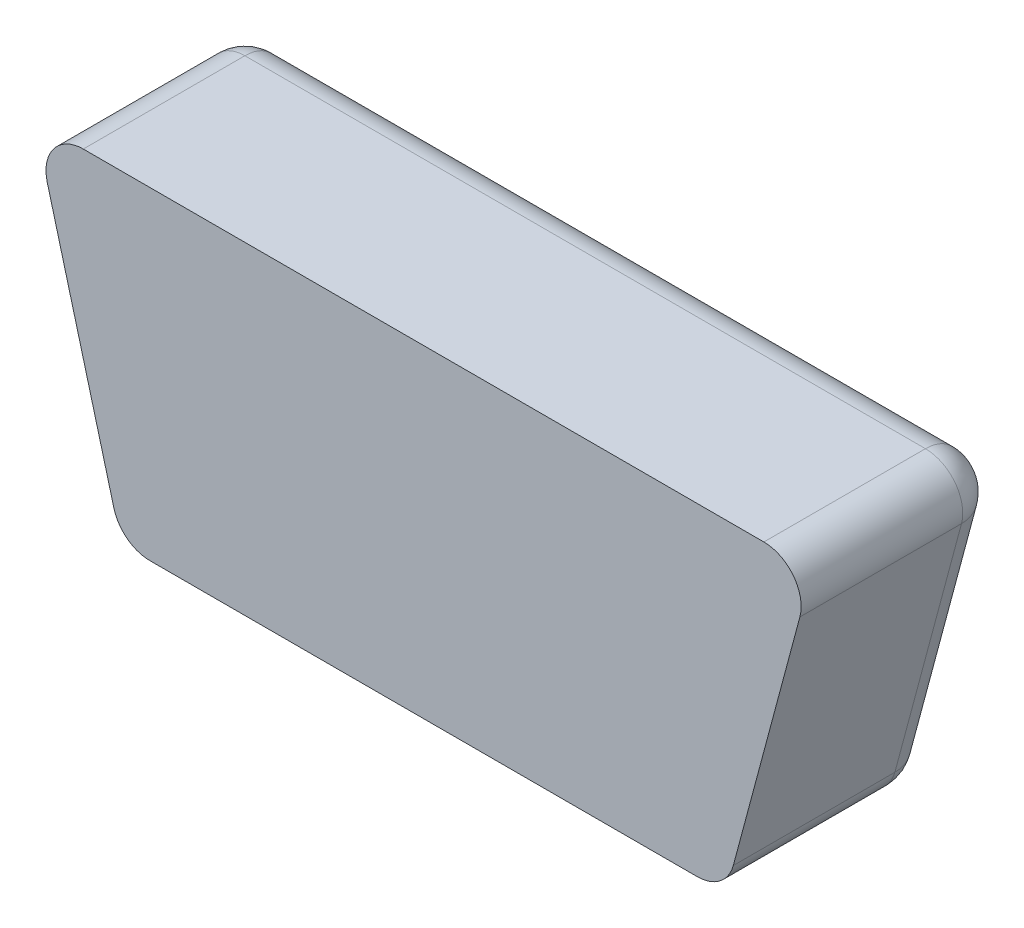
ISO-10303-21;
HEADER;
FILE_DESCRIPTION(('STEP AP214'),'2;1');
FILE_NAME('part.step','',(''),(''),'','','');
FILE_SCHEMA(('AUTOMOTIVE_DESIGN { 1 0 10303 214 1 1 1 1 }'));
ENDSEC;
DATA;
#1=APPLICATION_CONTEXT('core data for automotive mechanical design processes');
#2=APPLICATION_PROTOCOL_DEFINITION('international standard','automotive_design',2000,#1);
#3=PRODUCT_CONTEXT('',#1,'mechanical');
#4=PRODUCT('Part','Part','',(#3));
#5=PRODUCT_RELATED_PRODUCT_CATEGORY('part','',(#4));
#6=PRODUCT_DEFINITION_FORMATION('','',#4);
#7=PRODUCT_DEFINITION_CONTEXT('part definition',#1,'design');
#8=PRODUCT_DEFINITION('design','',#6,#7);
#9=PRODUCT_DEFINITION_SHAPE('','',#8);
#10=(LENGTH_UNIT() NAMED_UNIT(*) SI_UNIT(.MILLI.,.METRE.));
#11=(NAMED_UNIT(*) PLANE_ANGLE_UNIT() SI_UNIT($,.RADIAN.));
#12=(NAMED_UNIT(*) SI_UNIT($,.STERADIAN.) SOLID_ANGLE_UNIT());
#13=UNCERTAINTY_MEASURE_WITH_UNIT(LENGTH_MEASURE(1.E-05),#10,'distance_accuracy_value','');
#14=(GEOMETRIC_REPRESENTATION_CONTEXT(3) GLOBAL_UNCERTAINTY_ASSIGNED_CONTEXT((#13)) GLOBAL_UNIT_ASSIGNED_CONTEXT((#10,
#11,#12)) REPRESENTATION_CONTEXT('',''));
#15=CARTESIAN_POINT('',(0.,0.,0.));
#16=DIRECTION('',(0.,0.,1.));
#17=DIRECTION('',(1.,0.,0.));
#18=AXIS2_PLACEMENT_3D('',#15,#16,#17);
#19=CARTESIAN_POINT('',(-7.82166975080227,3.25,4.));
#20=DIRECTION('',(0.965925826289069,0.258819045102517,0.));
#21=DIRECTION('',(-0.258819045102517,0.965925826289069,0.));
#22=AXIS2_PLACEMENT_3D('',#19,#20,#21);
#23=PLANE('',#22);
#24=DIRECTION('',(0.258819045102517,-0.965925826289069,0.));
#25=VECTOR('',#24,1.);
#26=CARTESIAN_POINT('',(-7.82166975080227,3.25,4.));
#27=LINE('',#26,#25);
#28=CARTESIAN_POINT('',(-7.56869509088817,2.30588571617311,4.));
#29=VERTEX_POINT('',#28);
#30=CARTESIAN_POINT('',(-6.22894912873258,-2.69411428382689,4.));
#31=VERTEX_POINT('',#30);
#32=EDGE_CURVE('E114',#29,#31,#27,.T.);
#33=ORIENTED_EDGE('',*,*,#32,.F.);
#34=DIRECTION('',(0.,0.,-1.));
#35=VECTOR('',#34,1.);
#36=CARTESIAN_POINT('',(-7.56869509088817,2.30588571617311,4.));
#37=LINE('',#36,#35);
#38=CARTESIAN_POINT('',(-7.56869509088817,2.30588571617311,0.75));
#39=VERTEX_POINT('',#38);
#40=EDGE_CURVE('E126',#29,#39,#37,.T.);
#41=ORIENTED_EDGE('',*,*,#40,.T.);
#42=DIRECTION('',(0.258819045102517,-0.965925826289069,0.));
#43=VECTOR('',#42,1.);
#44=CARTESIAN_POINT('',(-7.82166975080227,3.25,0.75));
#45=LINE('',#44,#43);
#46=CARTESIAN_POINT('',(-6.22894912873258,-2.69411428382689,0.75));
#47=VERTEX_POINT('',#46);
#48=EDGE_CURVE('E139',#39,#47,#45,.T.);
#49=ORIENTED_EDGE('',*,*,#48,.T.);
#50=DIRECTION('',(0.,0.,-1.));
#51=VECTOR('',#50,1.);
#52=CARTESIAN_POINT('',(-6.22894912873258,-2.69411428382689,4.));
#53=LINE('',#52,#51);
#54=EDGE_CURVE('E128',#47,#31,#53,.F.);
#55=ORIENTED_EDGE('',*,*,#54,.T.);
#56=EDGE_LOOP('',(#33,#41,#49,#55));
#57=FACE_BOUND('',#56,.T.);
#58=ADVANCED_FACE('F34',(#57),#23,.F.);
#59=CARTESIAN_POINT('',(-6.08,-3.25,4.));
#60=DIRECTION('',(0.,1.,0.));
#61=DIRECTION('',(0.,0.,1.));
#62=AXIS2_PLACEMENT_3D('',#59,#60,#61);
#63=PLANE('',#62);
#64=DIRECTION('',(1.,0.,0.));
#65=VECTOR('',#64,1.);
#66=CARTESIAN_POINT('',(-6.08,-3.25,4.));
#67=LINE('',#66,#65);
#68=CARTESIAN_POINT('',(-5.50450475901578,-3.25,4.));
#69=VERTEX_POINT('',#68);
#70=CARTESIAN_POINT('',(5.50450475901578,-3.25,4.));
#71=VERTEX_POINT('',#70);
#72=EDGE_CURVE('E129',#69,#71,#67,.T.);
#73=ORIENTED_EDGE('',*,*,#72,.F.);
#74=DIRECTION('',(0.,0.,-1.));
#75=VECTOR('',#74,1.);
#76=CARTESIAN_POINT('',(-5.50450475901578,-3.25,4.));
#77=LINE('',#76,#75);
#78=CARTESIAN_POINT('',(-5.50450475901578,-3.25,0.75));
#79=VERTEX_POINT('',#78);
#80=EDGE_CURVE('E154',#69,#79,#77,.T.);
#81=ORIENTED_EDGE('',*,*,#80,.T.);
#82=DIRECTION('',(1.,0.,0.));
#83=VECTOR('',#82,1.);
#84=CARTESIAN_POINT('',(-6.08,-3.25,0.75));
#85=LINE('',#84,#83);
#86=CARTESIAN_POINT('',(5.50450475901578,-3.25,0.75));
#87=VERTEX_POINT('',#86);
#88=EDGE_CURVE('E152',#79,#87,#85,.T.);
#89=ORIENTED_EDGE('',*,*,#88,.T.);
#90=DIRECTION('',(0.,0.,-1.));
#91=VECTOR('',#90,1.);
#92=CARTESIAN_POINT('',(5.50450475901578,-3.25,4.));
#93=LINE('',#92,#91);
#94=EDGE_CURVE('E121',#87,#71,#93,.F.);
#95=ORIENTED_EDGE('',*,*,#94,.T.);
#96=EDGE_LOOP('',(#73,#81,#89,#95));
#97=FACE_BOUND('',#96,.T.);
#98=ADVANCED_FACE('F209',(#97),#63,.F.);
#99=CARTESIAN_POINT('',(6.08,-3.25,4.));
#100=DIRECTION('',(-0.965925826289069,0.258819045102518,0.));
#101=DIRECTION('',(-0.258819045102518,-0.965925826289069,0.));
#102=AXIS2_PLACEMENT_3D('',#99,#100,#101);
#103=PLANE('',#102);
#104=DIRECTION('',(0.258819045102518,0.965925826289069,0.));
#105=VECTOR('',#104,1.);
#106=CARTESIAN_POINT('',(6.08,-3.25,4.));
#107=LINE('',#106,#105);
#108=CARTESIAN_POINT('',(6.22894912873258,-2.69411428382689,4.));
#109=VERTEX_POINT('',#108);
#110=CARTESIAN_POINT('',(7.56869509088818,2.30588571617311,4.));
#111=VERTEX_POINT('',#110);
#112=EDGE_CURVE('E212',#109,#111,#107,.T.);
#113=ORIENTED_EDGE('',*,*,#112,.F.);
#114=DIRECTION('',(0.,0.,-1.));
#115=VECTOR('',#114,1.);
#116=CARTESIAN_POINT('',(6.22894912873258,-2.69411428382689,4.));
#117=LINE('',#116,#115);
#118=CARTESIAN_POINT('',(6.22894912873258,-2.69411428382689,0.75));
#119=VERTEX_POINT('',#118);
#120=EDGE_CURVE('E11',#109,#119,#117,.T.);
#121=ORIENTED_EDGE('',*,*,#120,.T.);
#122=DIRECTION('',(0.258819045102518,0.965925826289069,0.));
#123=VECTOR('',#122,1.);
#124=CARTESIAN_POINT('',(6.08,-3.25,0.75));
#125=LINE('',#124,#123);
#126=CARTESIAN_POINT('',(7.56869509088818,2.30588571617311,0.75));
#127=VERTEX_POINT('',#126);
#128=EDGE_CURVE('E43',#119,#127,#125,.T.);
#129=ORIENTED_EDGE('',*,*,#128,.T.);
#130=DIRECTION('',(0.,0.,-1.));
#131=VECTOR('',#130,1.);
#132=CARTESIAN_POINT('',(7.56869509088818,2.30588571617311,4.));
#133=LINE('',#132,#131);
#134=EDGE_CURVE('E165',#127,#111,#133,.F.);
#135=ORIENTED_EDGE('',*,*,#134,.T.);
#136=EDGE_LOOP('',(#113,#121,#129,#135));
#137=FACE_BOUND('',#136,.T.);
#138=ADVANCED_FACE('F249',(#137),#103,.F.);
#139=CARTESIAN_POINT('',(7.82166975080228,3.25,4.));
#140=DIRECTION('',(0.,-1.,0.));
#141=DIRECTION('',(0.,0.,-1.));
#142=AXIS2_PLACEMENT_3D('',#139,#140,#141);
#143=PLANE('',#142);
#144=DIRECTION('',(-1.,0.,0.));
#145=VECTOR('',#144,1.);
#146=CARTESIAN_POINT('',(7.82166975080228,3.25,0.75));
#147=LINE('',#146,#145);
#148=CARTESIAN_POINT('',(6.84425072117137,3.25,0.75));
#149=VERTEX_POINT('',#148);
#150=CARTESIAN_POINT('',(-6.84425072117137,3.25,0.75));
#151=VERTEX_POINT('',#150);
#152=EDGE_CURVE('E137',#149,#151,#147,.T.);
#153=ORIENTED_EDGE('',*,*,#152,.T.);
#154=DIRECTION('',(0.,0.,-1.));
#155=VECTOR('',#154,1.);
#156=CARTESIAN_POINT('',(-6.84425072117137,3.25,4.));
#157=LINE('',#156,#155);
#158=CARTESIAN_POINT('',(-6.84425072117137,3.25,4.));
#159=VERTEX_POINT('',#158);
#160=EDGE_CURVE('E144',#151,#159,#157,.F.);
#161=ORIENTED_EDGE('',*,*,#160,.T.);
#162=DIRECTION('',(-1.,0.,0.));
#163=VECTOR('',#162,1.);
#164=CARTESIAN_POINT('',(7.82166975080228,3.25,4.));
#165=LINE('',#164,#163);
#166=CARTESIAN_POINT('',(6.84425072117137,3.25,4.));
#167=VERTEX_POINT('',#166);
#168=EDGE_CURVE('E117',#167,#159,#165,.T.);
#169=ORIENTED_EDGE('',*,*,#168,.F.);
#170=DIRECTION('',(0.,0.,-1.));
#171=VECTOR('',#170,1.);
#172=CARTESIAN_POINT('',(6.84425072117137,3.25,4.));
#173=LINE('',#172,#171);
#174=EDGE_CURVE('E135',#167,#149,#173,.T.);
#175=ORIENTED_EDGE('',*,*,#174,.T.);
#176=EDGE_LOOP('',(#153,#161,#169,#175));
#177=FACE_BOUND('',#176,.T.);
#178=ADVANCED_FACE('F280',(#177),#143,.F.);
#179=CARTESIAN_POINT('',(0.,0.,4.));
#180=DIRECTION('',(0.,0.,1.));
#181=DIRECTION('',(1.,0.,0.));
#182=AXIS2_PLACEMENT_3D('',#179,#180,#181);
#183=PLANE('',#182);
#184=ORIENTED_EDGE('',*,*,#168,.T.);
#185=CARTESIAN_POINT('',(-6.84425072117137,2.5,4.));
#186=DIRECTION('',(0.,0.,1.));
#187=DIRECTION('',(1.,0.,0.));
#188=AXIS2_PLACEMENT_3D('',#185,#186,#187);
#189=CIRCLE('',#188,0.75);
#190=EDGE_CURVE('E111',#159,#29,#189,.T.);
#191=ORIENTED_EDGE('',*,*,#190,.T.);
#192=ORIENTED_EDGE('',*,*,#32,.T.);
#193=CARTESIAN_POINT('',(-5.50450475901578,-2.5,4.));
#194=DIRECTION('',(0.,0.,1.));
#195=DIRECTION('',(1.,0.,0.));
#196=AXIS2_PLACEMENT_3D('',#193,#194,#195);
#197=CIRCLE('',#196,0.75);
#198=EDGE_CURVE('E122',#31,#69,#197,.T.);
#199=ORIENTED_EDGE('',*,*,#198,.T.);
#200=ORIENTED_EDGE('',*,*,#72,.T.);
#201=CARTESIAN_POINT('',(5.50450475901578,-2.5,4.));
#202=DIRECTION('',(0.,0.,1.));
#203=DIRECTION('',(1.,0.,0.));
#204=AXIS2_PLACEMENT_3D('',#201,#202,#203);
#205=CIRCLE('',#204,0.75);
#206=EDGE_CURVE('E148',#71,#109,#205,.T.);
#207=ORIENTED_EDGE('',*,*,#206,.T.);
#208=ORIENTED_EDGE('',*,*,#112,.T.);
#209=CARTESIAN_POINT('',(6.84425072117137,2.5,4.));
#210=DIRECTION('',(0.,0.,1.));
#211=DIRECTION('',(1.,0.,0.));
#212=AXIS2_PLACEMENT_3D('',#209,#210,#211);
#213=CIRCLE('',#212,0.75);
#214=EDGE_CURVE('E146',#111,#167,#213,.T.);
#215=ORIENTED_EDGE('',*,*,#214,.T.);
#216=EDGE_LOOP('',(#184,#191,#192,#199,#200,#207,#208,#215));
#217=FACE_BOUND('',#216,.T.);
#218=ADVANCED_FACE('F113',(#217),#183,.T.);
#219=CARTESIAN_POINT('',(0.,0.,0.));
#220=DIRECTION('',(0.,0.,1.));
#221=DIRECTION('',(1.,0.,0.));
#222=AXIS2_PLACEMENT_3D('',#219,#220,#221);
#223=PLANE('',#222);
#224=DIRECTION('',(1.,0.,0.));
#225=VECTOR('',#224,1.);
#226=CARTESIAN_POINT('',(0.,-2.5,0.));
#227=LINE('',#226,#225);
#228=CARTESIAN_POINT('',(5.50450475901578,-2.5,0.));
#229=VERTEX_POINT('',#228);
#230=CARTESIAN_POINT('',(-5.50450475901578,-2.5,0.));
#231=VERTEX_POINT('',#230);
#232=EDGE_CURVE('E160',#229,#231,#227,.F.);
#233=ORIENTED_EDGE('',*,*,#232,.T.);
#234=DIRECTION('',(0.258819045102517,-0.965925826289069,0.));
#235=VECTOR('',#234,1.);
#236=CARTESIAN_POINT('',(-5.76077285778789,-1.54359443502337,0.));
#237=LINE('',#236,#235);
#238=CARTESIAN_POINT('',(-6.84425072117137,2.5,0.));
#239=VERTEX_POINT('',#238);
#240=EDGE_CURVE('E162',#231,#239,#237,.F.);
#241=ORIENTED_EDGE('',*,*,#240,.T.);
#242=DIRECTION('',(-1.,0.,0.));
#243=VECTOR('',#242,1.);
#244=CARTESIAN_POINT('',(0.,2.5,0.));
#245=LINE('',#244,#243);
#246=CARTESIAN_POINT('',(6.84425072117137,2.5,0.));
#247=VERTEX_POINT('',#246);
#248=EDGE_CURVE('E156',#239,#247,#245,.F.);
#249=ORIENTED_EDGE('',*,*,#248,.T.);
#250=DIRECTION('',(0.258819045102518,0.965925826289069,0.));
#251=VECTOR('',#250,1.);
#252=CARTESIAN_POINT('',(5.76077285778789,-1.54359443502338,0.));
#253=LINE('',#252,#251);
#254=EDGE_CURVE('E158',#247,#229,#253,.F.);
#255=ORIENTED_EDGE('',*,*,#254,.T.);
#256=EDGE_LOOP('',(#233,#241,#249,#255));
#257=FACE_BOUND('',#256,.T.);
#258=ADVANCED_FACE('F230',(#257),#223,.F.);
#259=CARTESIAN_POINT('',(5.50450475901578,-2.5,4.));
#260=DIRECTION('',(0.,0.,-1.));
#261=DIRECTION('',(-1.,0.,0.));
#262=AXIS2_PLACEMENT_3D('',#259,#260,#261);
#263=CYLINDRICAL_SURFACE('',#262,0.75);
#264=CARTESIAN_POINT('',(5.50450475901578,-2.5,0.75));
#265=DIRECTION('',(0.,0.,-1.));
#266=DIRECTION('',(-1.,0.,0.));
#267=AXIS2_PLACEMENT_3D('',#264,#265,#266);
#268=CIRCLE('',#267,0.75);
#269=EDGE_CURVE('E38',#119,#87,#268,.T.);
#270=ORIENTED_EDGE('',*,*,#269,.F.);
#271=ORIENTED_EDGE('',*,*,#120,.F.);
#272=ORIENTED_EDGE('',*,*,#206,.F.);
#273=ORIENTED_EDGE('',*,*,#94,.F.);
#274=EDGE_LOOP('',(#270,#271,#272,#273));
#275=FACE_BOUND('',#274,.T.);
#276=ADVANCED_FACE('F36',(#275),#263,.T.);
#277=CARTESIAN_POINT('',(5.50450475901578,-2.5,0.75));
#278=DIRECTION('',(0.,0.,1.));
#279=DIRECTION('',(1.,0.,0.));
#280=AXIS2_PLACEMENT_3D('',#277,#278,#279);
#281=SPHERICAL_SURFACE('',#280,0.75);
#282=CARTESIAN_POINT('',(5.50450475901578,-2.5,0.75));
#283=DIRECTION('',(-0.258819045102518,-0.965925826289069,0.));
#284=DIRECTION('',(0.965925826289069,-0.258819045102518,0.));
#285=AXIS2_PLACEMENT_3D('',#282,#283,#284);
#286=CIRCLE('',#285,0.75);
#287=EDGE_CURVE('E191',#119,#229,#286,.F.);
#288=ORIENTED_EDGE('',*,*,#287,.F.);
#289=ORIENTED_EDGE('',*,*,#269,.T.);
#290=CARTESIAN_POINT('',(5.50450475901578,-2.5,0.75));
#291=DIRECTION('',(1.,0.,0.));
#292=DIRECTION('',(0.,0.,-1.));
#293=AXIS2_PLACEMENT_3D('',#290,#291,#292);
#294=CIRCLE('',#293,0.75);
#295=EDGE_CURVE('E193',#229,#87,#294,.F.);
#296=ORIENTED_EDGE('',*,*,#295,.F.);
#297=EDGE_LOOP('',(#288,#289,#296));
#298=FACE_BOUND('',#297,.T.);
#299=ADVANCED_FACE('F202',(#298),#281,.T.);
#300=CARTESIAN_POINT('',(-5.50450475901578,-2.5,4.));
#301=DIRECTION('',(0.,0.,-1.));
#302=DIRECTION('',(-1.,0.,0.));
#303=AXIS2_PLACEMENT_3D('',#300,#301,#302);
#304=CYLINDRICAL_SURFACE('',#303,0.75);
#305=ORIENTED_EDGE('',*,*,#198,.F.);
#306=ORIENTED_EDGE('',*,*,#54,.F.);
#307=CARTESIAN_POINT('',(-5.50450475901578,-2.5,0.75));
#308=DIRECTION('',(0.,0.,-1.));
#309=DIRECTION('',(-1.,0.,0.));
#310=AXIS2_PLACEMENT_3D('',#307,#308,#309);
#311=CIRCLE('',#310,0.75);
#312=EDGE_CURVE('E188',#79,#47,#311,.T.);
#313=ORIENTED_EDGE('',*,*,#312,.F.);
#314=ORIENTED_EDGE('',*,*,#80,.F.);
#315=EDGE_LOOP('',(#305,#306,#313,#314));
#316=FACE_BOUND('',#315,.T.);
#317=ADVANCED_FACE('F221',(#316),#304,.T.);
#318=CARTESIAN_POINT('',(-6.08,-2.5,0.75));
#319=DIRECTION('',(1.,0.,0.));
#320=DIRECTION('',(0.,0.,-1.));
#321=AXIS2_PLACEMENT_3D('',#318,#319,#320);
#322=CYLINDRICAL_SURFACE('',#321,0.75);
#323=ORIENTED_EDGE('',*,*,#295,.T.);
#324=ORIENTED_EDGE('',*,*,#88,.F.);
#325=CARTESIAN_POINT('',(-5.50450475901578,-2.5,0.75));
#326=DIRECTION('',(-1.,0.,0.));
#327=DIRECTION('',(0.,0.,1.));
#328=AXIS2_PLACEMENT_3D('',#325,#326,#327);
#329=CIRCLE('',#328,0.75);
#330=EDGE_CURVE('E185',#231,#79,#329,.T.);
#331=ORIENTED_EDGE('',*,*,#330,.F.);
#332=ORIENTED_EDGE('',*,*,#232,.F.);
#333=EDGE_LOOP('',(#323,#324,#331,#332));
#334=FACE_BOUND('',#333,.T.);
#335=ADVANCED_FACE('F232',(#334),#322,.T.);
#336=CARTESIAN_POINT('',(5.3555556302832,-3.05588571617311,0.75));
#337=DIRECTION('',(0.258819045102518,0.965925826289069,0.));
#338=DIRECTION('',(-0.965925826289069,0.258819045102518,0.));
#339=AXIS2_PLACEMENT_3D('',#336,#337,#338);
#340=CYLINDRICAL_SURFACE('',#339,0.75);
#341=ORIENTED_EDGE('',*,*,#287,.T.);
#342=ORIENTED_EDGE('',*,*,#254,.F.);
#343=CARTESIAN_POINT('',(6.84425072117137,2.5,0.75));
#344=DIRECTION('',(0.258819045102518,0.965925826289069,0.));
#345=DIRECTION('',(-0.965925826289069,0.258819045102518,0.));
#346=AXIS2_PLACEMENT_3D('',#343,#344,#345);
#347=CIRCLE('',#346,0.75);
#348=EDGE_CURVE('E182',#127,#247,#347,.T.);
#349=ORIENTED_EDGE('',*,*,#348,.F.);
#350=ORIENTED_EDGE('',*,*,#128,.F.);
#351=EDGE_LOOP('',(#341,#342,#349,#350));
#352=FACE_BOUND('',#351,.T.);
#353=ADVANCED_FACE('F234',(#352),#340,.T.);
#354=CARTESIAN_POINT('',(6.84425072117137,2.5,4.));
#355=DIRECTION('',(0.,0.,-1.));
#356=DIRECTION('',(-1.,0.,0.));
#357=AXIS2_PLACEMENT_3D('',#354,#355,#356);
#358=CYLINDRICAL_SURFACE('',#357,0.75);
#359=ORIENTED_EDGE('',*,*,#214,.F.);
#360=ORIENTED_EDGE('',*,*,#134,.F.);
#361=CARTESIAN_POINT('',(6.84425072117137,2.5,0.75));
#362=DIRECTION('',(0.,0.,-1.));
#363=DIRECTION('',(-1.,0.,0.));
#364=AXIS2_PLACEMENT_3D('',#361,#362,#363);
#365=CIRCLE('',#364,0.75);
#366=EDGE_CURVE('E179',#149,#127,#365,.T.);
#367=ORIENTED_EDGE('',*,*,#366,.F.);
#368=ORIENTED_EDGE('',*,*,#174,.F.);
#369=EDGE_LOOP('',(#359,#360,#367,#368));
#370=FACE_BOUND('',#369,.T.);
#371=ADVANCED_FACE('F240',(#370),#358,.T.);
#372=CARTESIAN_POINT('',(-5.50450475901578,-2.5,0.75));
#373=DIRECTION('',(0.,0.,1.));
#374=DIRECTION('',(1.,0.,0.));
#375=AXIS2_PLACEMENT_3D('',#372,#373,#374);
#376=SPHERICAL_SURFACE('',#375,0.75);
#377=ORIENTED_EDGE('',*,*,#330,.T.);
#378=ORIENTED_EDGE('',*,*,#312,.T.);
#379=CARTESIAN_POINT('',(-5.50450475901578,-2.5,0.75));
#380=DIRECTION('',(0.258819045102517,-0.965925826289069,0.));
#381=DIRECTION('',(0.965925826289069,0.258819045102517,0.));
#382=AXIS2_PLACEMENT_3D('',#379,#380,#381);
#383=CIRCLE('',#382,0.75);
#384=EDGE_CURVE('E176',#231,#47,#383,.F.);
#385=ORIENTED_EDGE('',*,*,#384,.F.);
#386=EDGE_LOOP('',(#377,#378,#385));
#387=FACE_BOUND('',#386,.T.);
#388=ADVANCED_FACE('F224',(#387),#376,.T.);
#389=CARTESIAN_POINT('',(6.84425072117137,2.5,0.75));
#390=DIRECTION('',(0.,0.,1.));
#391=DIRECTION('',(1.,0.,0.));
#392=AXIS2_PLACEMENT_3D('',#389,#390,#391);
#393=SPHERICAL_SURFACE('',#392,0.75);
#394=ORIENTED_EDGE('',*,*,#366,.T.);
#395=ORIENTED_EDGE('',*,*,#348,.T.);
#396=CARTESIAN_POINT('',(6.84425072117137,2.5,0.75));
#397=DIRECTION('',(1.,0.,0.));
#398=DIRECTION('',(0.,0.,-1.));
#399=AXIS2_PLACEMENT_3D('',#396,#397,#398);
#400=CIRCLE('',#399,0.75);
#401=EDGE_CURVE('E173',#149,#247,#400,.F.);
#402=ORIENTED_EDGE('',*,*,#401,.F.);
#403=EDGE_LOOP('',(#394,#395,#402));
#404=FACE_BOUND('',#403,.T.);
#405=ADVANCED_FACE('F265',(#404),#393,.T.);
#406=CARTESIAN_POINT('',(-7.09722538108547,3.44411428382689,0.75));
#407=DIRECTION('',(0.258819045102517,-0.965925826289069,0.));
#408=DIRECTION('',(0.965925826289069,0.258819045102517,0.));
#409=AXIS2_PLACEMENT_3D('',#406,#407,#408);
#410=CYLINDRICAL_SURFACE('',#409,0.75);
#411=ORIENTED_EDGE('',*,*,#384,.T.);
#412=ORIENTED_EDGE('',*,*,#48,.F.);
#413=CARTESIAN_POINT('',(-6.84425072117137,2.5,0.75));
#414=DIRECTION('',(-0.258819045102517,0.965925826289069,0.));
#415=DIRECTION('',(-0.965925826289069,-0.258819045102517,0.));
#416=AXIS2_PLACEMENT_3D('',#413,#414,#415);
#417=CIRCLE('',#416,0.75);
#418=EDGE_CURVE('E171',#239,#39,#417,.T.);
#419=ORIENTED_EDGE('',*,*,#418,.F.);
#420=ORIENTED_EDGE('',*,*,#240,.F.);
#421=EDGE_LOOP('',(#411,#412,#419,#420));
#422=FACE_BOUND('',#421,.T.);
#423=ADVANCED_FACE('F227',(#422),#410,.T.);
#424=CARTESIAN_POINT('',(7.82166975080228,2.5,0.75));
#425=DIRECTION('',(-1.,0.,0.));
#426=DIRECTION('',(0.,0.,1.));
#427=AXIS2_PLACEMENT_3D('',#424,#425,#426);
#428=CYLINDRICAL_SURFACE('',#427,0.75);
#429=ORIENTED_EDGE('',*,*,#401,.T.);
#430=ORIENTED_EDGE('',*,*,#248,.F.);
#431=CARTESIAN_POINT('',(-6.84425072117137,2.5,0.75));
#432=DIRECTION('',(-1.,0.,0.));
#433=DIRECTION('',(0.,0.,1.));
#434=AXIS2_PLACEMENT_3D('',#431,#432,#433);
#435=CIRCLE('',#434,0.75);
#436=EDGE_CURVE('E169',#151,#239,#435,.T.);
#437=ORIENTED_EDGE('',*,*,#436,.F.);
#438=ORIENTED_EDGE('',*,*,#152,.F.);
#439=EDGE_LOOP('',(#429,#430,#437,#438));
#440=FACE_BOUND('',#439,.T.);
#441=ADVANCED_FACE('F258',(#440),#428,.T.);
#442=CARTESIAN_POINT('',(-6.84425072117137,2.5,0.75));
#443=DIRECTION('',(0.,0.,1.));
#444=DIRECTION('',(1.,0.,0.));
#445=AXIS2_PLACEMENT_3D('',#442,#443,#444);
#446=SPHERICAL_SURFACE('',#445,0.75);
#447=ORIENTED_EDGE('',*,*,#436,.T.);
#448=ORIENTED_EDGE('',*,*,#418,.T.);
#449=CARTESIAN_POINT('',(-6.84425072117137,2.5,0.75));
#450=DIRECTION('',(0.,0.,-1.));
#451=DIRECTION('',(-1.,0.,0.));
#452=AXIS2_PLACEMENT_3D('',#449,#450,#451);
#453=CIRCLE('',#452,0.75);
#454=EDGE_CURVE('E133',#151,#39,#453,.F.);
#455=ORIENTED_EDGE('',*,*,#454,.F.);
#456=EDGE_LOOP('',(#447,#448,#455));
#457=FACE_BOUND('',#456,.T.);
#458=ADVANCED_FACE('F255',(#457),#446,.T.);
#459=CARTESIAN_POINT('',(-6.84425072117137,2.5,4.));
#460=DIRECTION('',(0.,0.,-1.));
#461=DIRECTION('',(-1.,0.,0.));
#462=AXIS2_PLACEMENT_3D('',#459,#460,#461);
#463=CYLINDRICAL_SURFACE('',#462,0.75);
#464=ORIENTED_EDGE('',*,*,#190,.F.);
#465=ORIENTED_EDGE('',*,*,#160,.F.);
#466=ORIENTED_EDGE('',*,*,#454,.T.);
#467=ORIENTED_EDGE('',*,*,#40,.F.);
#468=EDGE_LOOP('',(#464,#465,#466,#467));
#469=FACE_BOUND('',#468,.T.);
#470=ADVANCED_FACE('F131',(#469),#463,.T.);
#471=CLOSED_SHELL('',(#58,#98,#138,#178,#218,#258,#276,#299,#317,#335,#353,#371,#388,#405,#423,
#441,#458,#470));
#472=MANIFOLD_SOLID_BREP('B2',#471);
#473=ADVANCED_BREP_SHAPE_REPRESENTATION('',(#18,#472),#14);
#474=SHAPE_DEFINITION_REPRESENTATION(#9,#473);
ENDSEC;
END-ISO-10303-21;
